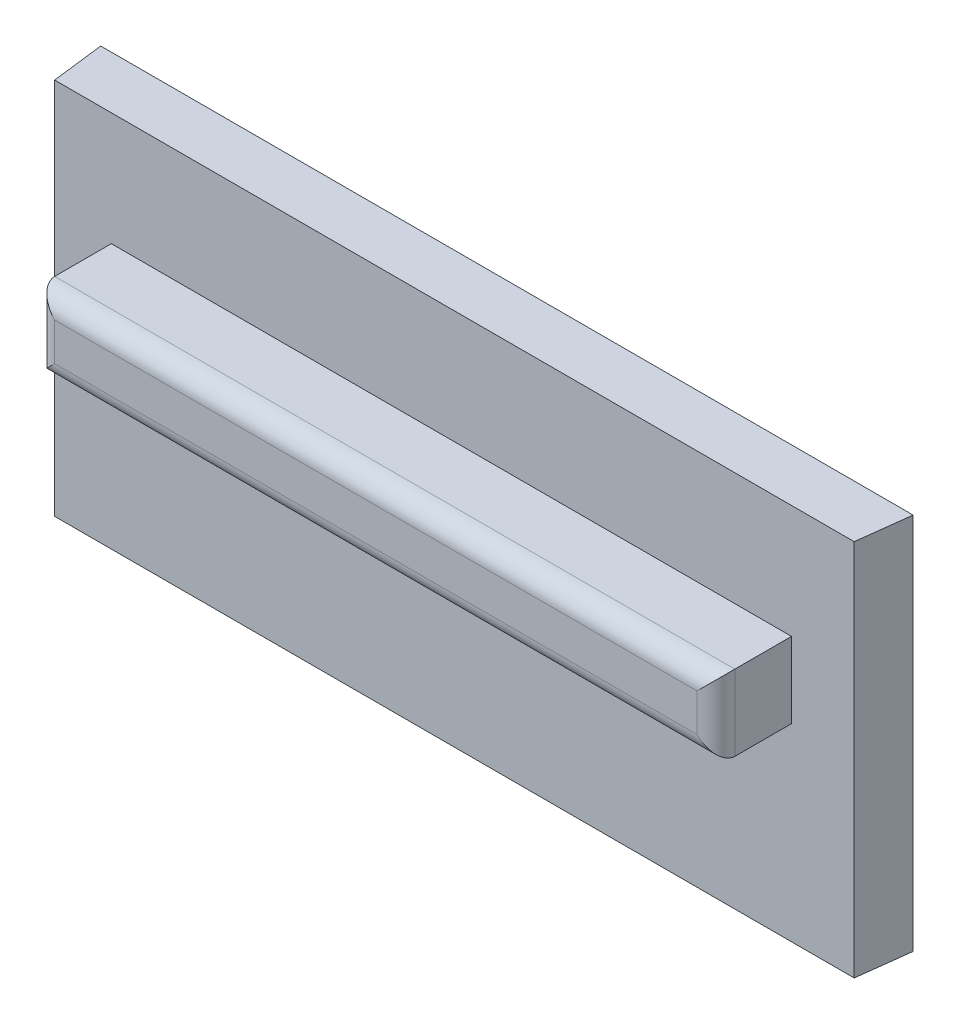
ISO-10303-21;
HEADER;
FILE_DESCRIPTION(('STEP AP214'),'2;1');
FILE_NAME('part.step','',(''),(''),'','','');
FILE_SCHEMA(('AUTOMOTIVE_DESIGN { 1 0 10303 214 1 1 1 1 }'));
ENDSEC;
DATA;
#1=APPLICATION_CONTEXT('core data for automotive mechanical design processes');
#2=APPLICATION_PROTOCOL_DEFINITION('international standard','automotive_design',2000,#1);
#3=PRODUCT_CONTEXT('',#1,'mechanical');
#4=PRODUCT('Part','Part','',(#3));
#5=PRODUCT_RELATED_PRODUCT_CATEGORY('part','',(#4));
#6=PRODUCT_DEFINITION_FORMATION('','',#4);
#7=PRODUCT_DEFINITION_CONTEXT('part definition',#1,'design');
#8=PRODUCT_DEFINITION('design','',#6,#7);
#9=PRODUCT_DEFINITION_SHAPE('','',#8);
#10=(LENGTH_UNIT() NAMED_UNIT(*) SI_UNIT(.MILLI.,.METRE.));
#11=(NAMED_UNIT(*) PLANE_ANGLE_UNIT() SI_UNIT($,.RADIAN.));
#12=(NAMED_UNIT(*) SI_UNIT($,.STERADIAN.) SOLID_ANGLE_UNIT());
#13=UNCERTAINTY_MEASURE_WITH_UNIT(LENGTH_MEASURE(1.E-05),#10,'distance_accuracy_value','');
#14=(GEOMETRIC_REPRESENTATION_CONTEXT(3) GLOBAL_UNCERTAINTY_ASSIGNED_CONTEXT((#13)) GLOBAL_UNIT_ASSIGNED_CONTEXT((#10,
#11,#12)) REPRESENTATION_CONTEXT('',''));
#15=CARTESIAN_POINT('',(0.,0.,0.));
#16=DIRECTION('',(0.,0.,1.));
#17=DIRECTION('',(1.,0.,0.));
#18=AXIS2_PLACEMENT_3D('',#15,#16,#17);
#19=CARTESIAN_POINT('',(0.415892602555734,10.,-89.6947369776039));
#20=DIRECTION('',(0.,0.,-1.));
#21=DIRECTION('',(-1.,0.,0.));
#22=AXIS2_PLACEMENT_3D('',#19,#20,#21);
#23=PLANE('',#22);
#24=DIRECTION('',(1.,0.,0.));
#25=VECTOR('',#24,1.);
#26=CARTESIAN_POINT('',(0.415892602555734,0.,-89.6947369776039));
#27=LINE('',#26,#25);
#28=CARTESIAN_POINT('',(0.415892602555734,0.,-89.6947369776039));
#29=VERTEX_POINT('',#28);
#30=CARTESIAN_POINT('',(21.5746584410213,0.,-89.6947369776039));
#31=VERTEX_POINT('',#30);
#32=EDGE_CURVE('E136',#29,#31,#27,.T.);
#33=ORIENTED_EDGE('',*,*,#32,.T.);
#34=DIRECTION('',(0.,-1.,0.));
#35=VECTOR('',#34,1.);
#36=CARTESIAN_POINT('',(21.5746584410213,10.,-89.6947369776039));
#37=LINE('',#36,#35);
#38=CARTESIAN_POINT('',(21.5746584410213,10.,-89.6947369776039));
#39=VERTEX_POINT('',#38);
#40=EDGE_CURVE('E163',#39,#31,#37,.T.);
#41=ORIENTED_EDGE('',*,*,#40,.F.);
#42=DIRECTION('',(1.,0.,0.));
#43=VECTOR('',#42,1.);
#44=CARTESIAN_POINT('',(0.415892602555734,10.,-89.6947369776039));
#45=LINE('',#44,#43);
#46=CARTESIAN_POINT('',(0.415892602555734,10.,-89.6947369776039));
#47=VERTEX_POINT('',#46);
#48=EDGE_CURVE('E137',#47,#39,#45,.T.);
#49=ORIENTED_EDGE('',*,*,#48,.F.);
#50=DIRECTION('',(0.,-1.,0.));
#51=VECTOR('',#50,1.);
#52=CARTESIAN_POINT('',(0.415892602555734,10.,-89.6947369776039));
#53=LINE('',#52,#51);
#54=EDGE_CURVE('E147',#47,#29,#53,.T.);
#55=ORIENTED_EDGE('',*,*,#54,.T.);
#56=EDGE_LOOP('',(#33,#41,#49,#55));
#57=FACE_BOUND('',#56,.T.);
#58=DIRECTION('',(0.,-1.,0.));
#59=VECTOR('',#58,1.);
#60=CARTESIAN_POINT('',(1.91589260255573,5.,-89.6947369776039));
#61=LINE('',#60,#59);
#62=CARTESIAN_POINT('',(1.91589260255573,7.,-89.6947369776039));
#63=VERTEX_POINT('',#62);
#64=CARTESIAN_POINT('',(1.91589260255573,5.,-89.6947369776039));
#65=VERTEX_POINT('',#64);
#66=EDGE_CURVE('E127',#63,#65,#61,.T.);
#67=ORIENTED_EDGE('',*,*,#66,.F.);
#68=DIRECTION('',(-1.,0.,0.));
#69=VECTOR('',#68,1.);
#70=CARTESIAN_POINT('',(1.91589260255573,7.,-89.6947369776039));
#71=LINE('',#70,#69);
#72=CARTESIAN_POINT('',(19.9158926025557,7.,-89.6947369776039));
#73=VERTEX_POINT('',#72);
#74=EDGE_CURVE('E124',#73,#63,#71,.T.);
#75=ORIENTED_EDGE('',*,*,#74,.F.);
#76=DIRECTION('',(0.,1.,0.));
#77=VECTOR('',#76,1.);
#78=CARTESIAN_POINT('',(19.9158926025557,5.,-89.6947369776039));
#79=LINE('',#78,#77);
#80=CARTESIAN_POINT('',(19.9158926025557,5.,-89.6947369776039));
#81=VERTEX_POINT('',#80);
#82=EDGE_CURVE('E112',#81,#73,#79,.T.);
#83=ORIENTED_EDGE('',*,*,#82,.F.);
#84=DIRECTION('',(1.,0.,0.));
#85=VECTOR('',#84,1.);
#86=CARTESIAN_POINT('',(1.91589260255573,5.,-89.6947369776039));
#87=LINE('',#86,#85);
#88=EDGE_CURVE('E121',#65,#81,#87,.T.);
#89=ORIENTED_EDGE('',*,*,#88,.F.);
#90=EDGE_LOOP('',(#67,#75,#83,#89));
#91=FACE_BOUND('',#90,.T.);
#92=ADVANCED_FACE('F33',(#57,#91),#23,.F.);
#93=CARTESIAN_POINT('',(21.5746584410213,10.,-89.6947369776039));
#94=DIRECTION('',(-0.992546151641322,0.,-0.121869343405146));
#95=DIRECTION('',(-0.121869343405146,0.,0.992546151641322));
#96=AXIS2_PLACEMENT_3D('',#93,#94,#95);
#97=PLANE('',#96);
#98=DIRECTION('',(0.121869343405146,0.,-0.992546151641322));
#99=VECTOR('',#98,1.);
#100=CARTESIAN_POINT('',(21.5746584410213,0.,-89.6947369776039));
#101=LINE('',#100,#99);
#102=CARTESIAN_POINT('',(21.7452755217885,0.,-91.0843015899018));
#103=VERTEX_POINT('',#102);
#104=EDGE_CURVE('E150',#31,#103,#101,.T.);
#105=ORIENTED_EDGE('',*,*,#104,.T.);
#106=DIRECTION('',(0.,-1.,0.));
#107=VECTOR('',#106,1.);
#108=CARTESIAN_POINT('',(21.7452755217885,10.,-91.0843015899018));
#109=LINE('',#108,#107);
#110=CARTESIAN_POINT('',(21.7452755217885,10.,-91.0843015899018));
#111=VERTEX_POINT('',#110);
#112=EDGE_CURVE('E160',#111,#103,#109,.T.);
#113=ORIENTED_EDGE('',*,*,#112,.F.);
#114=DIRECTION('',(0.121869343405146,0.,-0.992546151641322));
#115=VECTOR('',#114,1.);
#116=CARTESIAN_POINT('',(21.5746584410213,10.,-89.6947369776039));
#117=LINE('',#116,#115);
#118=EDGE_CURVE('E140',#39,#111,#117,.T.);
#119=ORIENTED_EDGE('',*,*,#118,.F.);
#120=ORIENTED_EDGE('',*,*,#40,.T.);
#121=EDGE_LOOP('',(#105,#113,#119,#120));
#122=FACE_BOUND('',#121,.T.);
#123=ADVANCED_FACE('F218',(#122),#97,.F.);
#124=CARTESIAN_POINT('',(0.245275521788497,10.,-91.0843015899018));
#125=DIRECTION('',(0.,0.,1.));
#126=DIRECTION('',(1.,0.,0.));
#127=AXIS2_PLACEMENT_3D('',#124,#125,#126);
#128=PLANE('',#127);
#129=DIRECTION('',(-1.,0.,0.));
#130=VECTOR('',#129,1.);
#131=CARTESIAN_POINT('',(0.245275521788497,0.,-91.0843015899018));
#132=LINE('',#131,#130);
#133=CARTESIAN_POINT('',(0.245275521788497,0.,-91.0843015899018));
#134=VERTEX_POINT('',#133);
#135=EDGE_CURVE('E152',#103,#134,#132,.T.);
#136=ORIENTED_EDGE('',*,*,#135,.T.);
#137=DIRECTION('',(0.,-1.,0.));
#138=VECTOR('',#137,1.);
#139=CARTESIAN_POINT('',(0.245275521788497,10.,-91.0843015899018));
#140=LINE('',#139,#138);
#141=CARTESIAN_POINT('',(0.245275521788497,10.,-91.0843015899018));
#142=VERTEX_POINT('',#141);
#143=EDGE_CURVE('E157',#142,#134,#140,.T.);
#144=ORIENTED_EDGE('',*,*,#143,.F.);
#145=DIRECTION('',(-1.,0.,0.));
#146=VECTOR('',#145,1.);
#147=CARTESIAN_POINT('',(0.245275521788497,10.,-91.0843015899018));
#148=LINE('',#147,#146);
#149=EDGE_CURVE('E143',#111,#142,#148,.T.);
#150=ORIENTED_EDGE('',*,*,#149,.F.);
#151=ORIENTED_EDGE('',*,*,#112,.T.);
#152=EDGE_LOOP('',(#136,#144,#150,#151));
#153=FACE_BOUND('',#152,.T.);
#154=ADVANCED_FACE('F224',(#153),#128,.F.);
#155=CARTESIAN_POINT('',(0.415892602555734,10.,-89.6947369776039));
#156=DIRECTION('',(0.992546151641319,0.,-0.121869343405169));
#157=DIRECTION('',(-0.121869343405169,0.,-0.99254615164132));
#158=AXIS2_PLACEMENT_3D('',#155,#156,#157);
#159=PLANE('',#158);
#160=DIRECTION('',(0.121869343405169,0.,0.992546151641319));
#161=VECTOR('',#160,1.);
#162=CARTESIAN_POINT('',(0.415892602555734,0.,-89.6947369776039));
#163=LINE('',#162,#161);
#164=EDGE_CURVE('E141',#134,#29,#163,.T.);
#165=ORIENTED_EDGE('',*,*,#164,.T.);
#166=ORIENTED_EDGE('',*,*,#54,.F.);
#167=DIRECTION('',(0.121869343405169,0.,0.992546151641319));
#168=VECTOR('',#167,1.);
#169=CARTESIAN_POINT('',(0.415892602555734,10.,-89.6947369776039));
#170=LINE('',#169,#168);
#171=EDGE_CURVE('E145',#142,#47,#170,.T.);
#172=ORIENTED_EDGE('',*,*,#171,.F.);
#173=ORIENTED_EDGE('',*,*,#143,.T.);
#174=EDGE_LOOP('',(#165,#166,#172,#173));
#175=FACE_BOUND('',#174,.T.);
#176=ADVANCED_FACE('F307',(#175),#159,.F.);
#177=CARTESIAN_POINT('',(0.,10.,0.));
#178=DIRECTION('',(0.,1.,0.));
#179=DIRECTION('',(0.,0.,1.));
#180=AXIS2_PLACEMENT_3D('',#177,#178,#179);
#181=PLANE('',#180);
#182=ORIENTED_EDGE('',*,*,#48,.T.);
#183=ORIENTED_EDGE('',*,*,#118,.T.);
#184=ORIENTED_EDGE('',*,*,#149,.T.);
#185=ORIENTED_EDGE('',*,*,#171,.T.);
#186=EDGE_LOOP('',(#182,#183,#184,#185));
#187=FACE_BOUND('',#186,.T.);
#188=ADVANCED_FACE('F298',(#187),#181,.T.);
#189=CARTESIAN_POINT('',(0.,0.,0.));
#190=DIRECTION('',(0.,1.,0.));
#191=DIRECTION('',(0.,0.,1.));
#192=AXIS2_PLACEMENT_3D('',#189,#190,#191);
#193=PLANE('',#192);
#194=ORIENTED_EDGE('',*,*,#32,.F.);
#195=ORIENTED_EDGE('',*,*,#164,.F.);
#196=ORIENTED_EDGE('',*,*,#135,.F.);
#197=ORIENTED_EDGE('',*,*,#104,.F.);
#198=EDGE_LOOP('',(#194,#195,#196,#197));
#199=FACE_BOUND('',#198,.T.);
#200=ADVANCED_FACE('F286',(#199),#193,.F.);
#201=CARTESIAN_POINT('',(1.91589260255573,5.,-87.6947369776039));
#202=DIRECTION('',(1.,0.,0.));
#203=DIRECTION('',(0.,0.,-1.));
#204=AXIS2_PLACEMENT_3D('',#201,#202,#203);
#205=PLANE('',#204);
#206=DIRECTION('',(0.,0.,-1.));
#207=VECTOR('',#206,1.);
#208=CARTESIAN_POINT('',(1.91589260255573,5.,-87.6947369776039));
#209=LINE('',#208,#207);
#210=CARTESIAN_POINT('',(1.91589260255573,5.,-88.1947369776039));
#211=VERTEX_POINT('',#210);
#212=EDGE_CURVE('E114',#211,#65,#209,.T.);
#213=ORIENTED_EDGE('',*,*,#212,.F.);
#214=DIRECTION('',(0.,-1.,0.));
#215=VECTOR('',#214,1.);
#216=CARTESIAN_POINT('',(1.91589260255573,5.,-88.1947369776039));
#217=LINE('',#216,#215);
#218=CARTESIAN_POINT('',(1.91589260255573,7.,-88.1947369776039));
#219=VERTEX_POINT('',#218);
#220=EDGE_CURVE('E11',#211,#219,#217,.F.);
#221=ORIENTED_EDGE('',*,*,#220,.T.);
#222=DIRECTION('',(0.,0.,-1.));
#223=VECTOR('',#222,1.);
#224=CARTESIAN_POINT('',(1.91589260255573,7.,-87.6947369776039));
#225=LINE('',#224,#223);
#226=EDGE_CURVE('E132',#219,#63,#225,.T.);
#227=ORIENTED_EDGE('',*,*,#226,.T.);
#228=ORIENTED_EDGE('',*,*,#66,.T.);
#229=EDGE_LOOP('',(#213,#221,#227,#228));
#230=FACE_BOUND('',#229,.T.);
#231=ADVANCED_FACE('F201',(#230),#205,.F.);
#232=CARTESIAN_POINT('',(1.91589260255573,5.,-87.6947369776039));
#233=DIRECTION('',(0.,1.,0.));
#234=DIRECTION('',(0.,0.,1.));
#235=AXIS2_PLACEMENT_3D('',#232,#233,#234);
#236=PLANE('',#235);
#237=DIRECTION('',(0.,0.,-1.));
#238=VECTOR('',#237,1.);
#239=CARTESIAN_POINT('',(19.9158926025557,5.,-87.6947369776039));
#240=LINE('',#239,#238);
#241=CARTESIAN_POINT('',(19.9158926025557,5.,-88.1947369776039));
#242=VERTEX_POINT('',#241);
#243=EDGE_CURVE('E109',#242,#81,#240,.T.);
#244=ORIENTED_EDGE('',*,*,#243,.F.);
#245=DIRECTION('',(1.,0.,0.));
#246=VECTOR('',#245,1.);
#247=CARTESIAN_POINT('',(1.91589260255573,5.,-88.1947369776039));
#248=LINE('',#247,#246);
#249=EDGE_CURVE('E42',#242,#211,#248,.F.);
#250=ORIENTED_EDGE('',*,*,#249,.T.);
#251=ORIENTED_EDGE('',*,*,#212,.T.);
#252=ORIENTED_EDGE('',*,*,#88,.T.);
#253=EDGE_LOOP('',(#244,#250,#251,#252));
#254=FACE_BOUND('',#253,.T.);
#255=ADVANCED_FACE('F126',(#254),#236,.F.);
#256=CARTESIAN_POINT('',(19.9158926025557,5.,-87.6947369776039));
#257=DIRECTION('',(-1.,0.,0.));
#258=DIRECTION('',(0.,0.,1.));
#259=AXIS2_PLACEMENT_3D('',#256,#257,#258);
#260=PLANE('',#259);
#261=DIRECTION('',(0.,0.,-1.));
#262=VECTOR('',#261,1.);
#263=CARTESIAN_POINT('',(19.9158926025557,7.,-87.6947369776039));
#264=LINE('',#263,#262);
#265=CARTESIAN_POINT('',(19.9158926025557,7.,-88.1947369776039));
#266=VERTEX_POINT('',#265);
#267=EDGE_CURVE('E115',#266,#73,#264,.T.);
#268=ORIENTED_EDGE('',*,*,#267,.F.);
#269=DIRECTION('',(0.,1.,0.));
#270=VECTOR('',#269,1.);
#271=CARTESIAN_POINT('',(19.9158926025557,5.,-88.1947369776039));
#272=LINE('',#271,#270);
#273=EDGE_CURVE('E57',#266,#242,#272,.F.);
#274=ORIENTED_EDGE('',*,*,#273,.T.);
#275=ORIENTED_EDGE('',*,*,#243,.T.);
#276=ORIENTED_EDGE('',*,*,#82,.T.);
#277=EDGE_LOOP('',(#268,#274,#275,#276));
#278=FACE_BOUND('',#277,.T.);
#279=ADVANCED_FACE('F111',(#278),#260,.F.);
#280=CARTESIAN_POINT('',(1.91589260255573,7.,-87.6947369776039));
#281=DIRECTION('',(0.,-1.,0.));
#282=DIRECTION('',(0.,0.,-1.));
#283=AXIS2_PLACEMENT_3D('',#280,#281,#282);
#284=PLANE('',#283);
#285=ORIENTED_EDGE('',*,*,#226,.F.);
#286=DIRECTION('',(-1.,0.,0.));
#287=VECTOR('',#286,1.);
#288=CARTESIAN_POINT('',(1.91589260255573,7.,-88.1947369776039));
#289=LINE('',#288,#287);
#290=EDGE_CURVE('E175',#219,#266,#289,.F.);
#291=ORIENTED_EDGE('',*,*,#290,.T.);
#292=ORIENTED_EDGE('',*,*,#267,.T.);
#293=ORIENTED_EDGE('',*,*,#74,.T.);
#294=EDGE_LOOP('',(#285,#291,#292,#293));
#295=FACE_BOUND('',#294,.T.);
#296=ADVANCED_FACE('F204',(#295),#284,.F.);
#297=CARTESIAN_POINT('',(0.,0.,-87.6947369776039));
#298=DIRECTION('',(0.,0.,-1.));
#299=DIRECTION('',(-1.,0.,0.));
#300=AXIS2_PLACEMENT_3D('',#297,#298,#299);
#301=PLANE('',#300);
#302=DIRECTION('',(0.,1.,0.));
#303=VECTOR('',#302,1.);
#304=CARTESIAN_POINT('',(19.4158926025557,0.,-87.6947369776039));
#305=LINE('',#304,#303);
#306=CARTESIAN_POINT('',(19.4158926025557,5.5,-87.6947369776039));
#307=VERTEX_POINT('',#306);
#308=CARTESIAN_POINT('',(19.4158926025557,6.5,-87.6947369776039));
#309=VERTEX_POINT('',#308);
#310=EDGE_CURVE('E170',#307,#309,#305,.T.);
#311=ORIENTED_EDGE('',*,*,#310,.T.);
#312=DIRECTION('',(-1.,0.,0.));
#313=VECTOR('',#312,1.);
#314=CARTESIAN_POINT('',(0.,6.5,-87.6947369776039));
#315=LINE('',#314,#313);
#316=CARTESIAN_POINT('',(2.41589260255573,6.5,-87.6947369776039));
#317=VERTEX_POINT('',#316);
#318=EDGE_CURVE('E172',#309,#317,#315,.T.);
#319=ORIENTED_EDGE('',*,*,#318,.T.);
#320=DIRECTION('',(0.,-1.,0.));
#321=VECTOR('',#320,1.);
#322=CARTESIAN_POINT('',(2.41589260255573,0.,-87.6947369776039));
#323=LINE('',#322,#321);
#324=CARTESIAN_POINT('',(2.41589260255573,5.5,-87.6947369776039));
#325=VERTEX_POINT('',#324);
#326=EDGE_CURVE('E166',#317,#325,#323,.T.);
#327=ORIENTED_EDGE('',*,*,#326,.T.);
#328=DIRECTION('',(1.,0.,0.));
#329=VECTOR('',#328,1.);
#330=CARTESIAN_POINT('',(0.,5.5,-87.6947369776039));
#331=LINE('',#330,#329);
#332=EDGE_CURVE('E168',#325,#307,#331,.T.);
#333=ORIENTED_EDGE('',*,*,#332,.T.);
#334=EDGE_LOOP('',(#311,#319,#327,#333));
#335=FACE_BOUND('',#334,.T.);
#336=ADVANCED_FACE('F209',(#335),#301,.F.);
#337=CARTESIAN_POINT('',(0.,5.5,-88.1947369776039));
#338=DIRECTION('',(1.,0.,0.));
#339=DIRECTION('',(0.,0.,-1.));
#340=AXIS2_PLACEMENT_3D('',#337,#338,#339);
#341=CYLINDRICAL_SURFACE('',#340,0.5);
#342=CARTESIAN_POINT('',(2.41589260255573,5.5,-88.1947369776039));
#343=DIRECTION('',(0.707106781186547,-0.707106781186547,0.));
#344=DIRECTION('',(-0.707106781186547,-0.707106781186547,0.));
#345=AXIS2_PLACEMENT_3D('',#342,#343,#344);
#346=ELLIPSE('',#345,0.707106781186547,0.5);
#347=EDGE_CURVE('E183',#211,#325,#346,.F.);
#348=ORIENTED_EDGE('',*,*,#347,.F.);
#349=ORIENTED_EDGE('',*,*,#249,.F.);
#350=CARTESIAN_POINT('',(19.4158926025557,5.5,-88.1947369776039));
#351=DIRECTION('',(0.707106781186547,0.707106781186547,0.));
#352=DIRECTION('',(0.707106781186547,-0.707106781186547,0.));
#353=AXIS2_PLACEMENT_3D('',#350,#351,#352);
#354=ELLIPSE('',#353,0.707106781186547,0.5);
#355=EDGE_CURVE('E37',#307,#242,#354,.T.);
#356=ORIENTED_EDGE('',*,*,#355,.F.);
#357=ORIENTED_EDGE('',*,*,#332,.F.);
#358=EDGE_LOOP('',(#348,#349,#356,#357));
#359=FACE_BOUND('',#358,.T.);
#360=ADVANCED_FACE('F35',(#359),#341,.T.);
#361=CARTESIAN_POINT('',(19.4158926025557,0.,-88.1947369776039));
#362=DIRECTION('',(0.,1.,0.));
#363=DIRECTION('',(0.,0.,1.));
#364=AXIS2_PLACEMENT_3D('',#361,#362,#363);
#365=CYLINDRICAL_SURFACE('',#364,0.5);
#366=ORIENTED_EDGE('',*,*,#355,.T.);
#367=ORIENTED_EDGE('',*,*,#273,.F.);
#368=CARTESIAN_POINT('',(19.4158926025557,6.5,-88.1947369776039));
#369=DIRECTION('',(-0.707106781186547,0.707106781186547,0.));
#370=DIRECTION('',(0.707106781186547,0.707106781186547,0.));
#371=AXIS2_PLACEMENT_3D('',#368,#369,#370);
#372=ELLIPSE('',#371,0.707106781186547,0.5);
#373=EDGE_CURVE('E182',#309,#266,#372,.T.);
#374=ORIENTED_EDGE('',*,*,#373,.F.);
#375=ORIENTED_EDGE('',*,*,#310,.F.);
#376=EDGE_LOOP('',(#366,#367,#374,#375));
#377=FACE_BOUND('',#376,.T.);
#378=ADVANCED_FACE('F193',(#377),#365,.T.);
#379=CARTESIAN_POINT('',(2.41589260255573,0.,-88.1947369776039));
#380=DIRECTION('',(0.,-1.,0.));
#381=DIRECTION('',(0.,0.,-1.));
#382=AXIS2_PLACEMENT_3D('',#379,#380,#381);
#383=CYLINDRICAL_SURFACE('',#382,0.5);
#384=ORIENTED_EDGE('',*,*,#347,.T.);
#385=ORIENTED_EDGE('',*,*,#326,.F.);
#386=CARTESIAN_POINT('',(2.41589260255573,6.5,-88.1947369776039));
#387=DIRECTION('',(-0.707106781186547,-0.707106781186547,0.));
#388=DIRECTION('',(0.707106781186547,-0.707106781186547,0.));
#389=AXIS2_PLACEMENT_3D('',#386,#387,#388);
#390=ELLIPSE('',#389,0.707106781186547,0.5);
#391=EDGE_CURVE('E180',#219,#317,#390,.F.);
#392=ORIENTED_EDGE('',*,*,#391,.F.);
#393=ORIENTED_EDGE('',*,*,#220,.F.);
#394=EDGE_LOOP('',(#384,#385,#392,#393));
#395=FACE_BOUND('',#394,.T.);
#396=ADVANCED_FACE('F198',(#395),#383,.T.);
#397=CARTESIAN_POINT('',(0.,6.5,-88.1947369776039));
#398=DIRECTION('',(-1.,0.,0.));
#399=DIRECTION('',(0.,0.,1.));
#400=AXIS2_PLACEMENT_3D('',#397,#398,#399);
#401=CYLINDRICAL_SURFACE('',#400,0.5);
#402=ORIENTED_EDGE('',*,*,#373,.T.);
#403=ORIENTED_EDGE('',*,*,#290,.F.);
#404=ORIENTED_EDGE('',*,*,#391,.T.);
#405=ORIENTED_EDGE('',*,*,#318,.F.);
#406=EDGE_LOOP('',(#402,#403,#404,#405));
#407=FACE_BOUND('',#406,.T.);
#408=ADVANCED_FACE('F206',(#407),#401,.T.);
#409=CLOSED_SHELL('',(#92,#123,#154,#176,#188,#200,#231,#255,#279,#296,#336,#360,#378,#396,#408));
#410=MANIFOLD_SOLID_BREP('B2',#409);
#411=ADVANCED_BREP_SHAPE_REPRESENTATION('',(#18,#410),#14);
#412=SHAPE_DEFINITION_REPRESENTATION(#9,#411);
ENDSEC;
END-ISO-10303-21;
